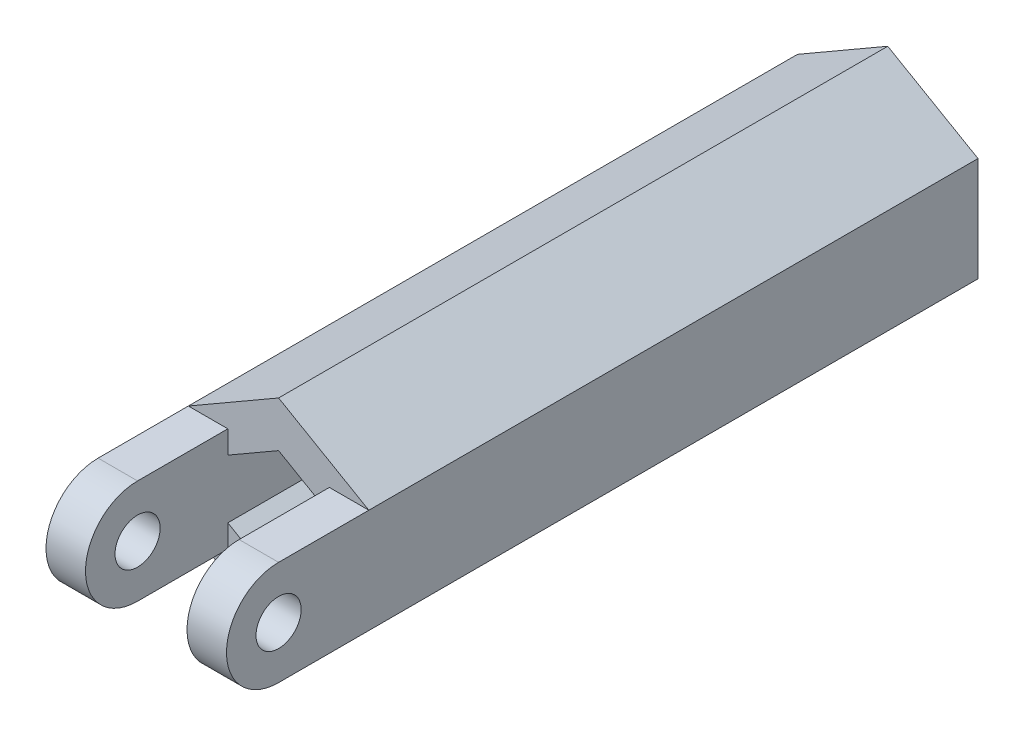
ISO-10303-21;
HEADER;
FILE_DESCRIPTION(('STEP AP214'),'2;1');
FILE_NAME('part.step','',(''),(''),'','','');
FILE_SCHEMA(('AUTOMOTIVE_DESIGN { 1 0 10303 214 1 1 1 1 }'));
ENDSEC;
DATA;
#1=APPLICATION_CONTEXT('core data for automotive mechanical design processes');
#2=APPLICATION_PROTOCOL_DEFINITION('international standard','automotive_design',2000,#1);
#3=PRODUCT_CONTEXT('',#1,'mechanical');
#4=PRODUCT('Part','Part','',(#3));
#5=PRODUCT_RELATED_PRODUCT_CATEGORY('part','',(#4));
#6=PRODUCT_DEFINITION_FORMATION('','',#4);
#7=PRODUCT_DEFINITION_CONTEXT('part definition',#1,'design');
#8=PRODUCT_DEFINITION('design','',#6,#7);
#9=PRODUCT_DEFINITION_SHAPE('','',#8);
#10=(LENGTH_UNIT() NAMED_UNIT(*) SI_UNIT(.MILLI.,.METRE.));
#11=(NAMED_UNIT(*) PLANE_ANGLE_UNIT() SI_UNIT($,.RADIAN.));
#12=(NAMED_UNIT(*) SI_UNIT($,.STERADIAN.) SOLID_ANGLE_UNIT());
#13=UNCERTAINTY_MEASURE_WITH_UNIT(LENGTH_MEASURE(1.E-05),#10,'distance_accuracy_value','');
#14=(GEOMETRIC_REPRESENTATION_CONTEXT(3) GLOBAL_UNCERTAINTY_ASSIGNED_CONTEXT((#13)) GLOBAL_UNIT_ASSIGNED_CONTEXT((#10,
#11,#12)) REPRESENTATION_CONTEXT('',''));
#15=CARTESIAN_POINT('',(0.,0.,0.));
#16=DIRECTION('',(0.,0.,1.));
#17=DIRECTION('',(1.,0.,0.));
#18=AXIS2_PLACEMENT_3D('',#15,#16,#17);
#19=CARTESIAN_POINT('',(0.,0.,25.));
#20=DIRECTION('',(0.,0.,1.));
#21=DIRECTION('',(1.,0.,0.));
#22=AXIS2_PLACEMENT_3D('',#19,#20,#21);
#23=PLANE('',#22);
#24=DIRECTION('',(1.,0.,0.));
#25=VECTOR('',#24,1.);
#26=CARTESIAN_POINT('',(-5.56932703502896,2.30940107675851,25.));
#27=LINE('',#26,#25);
#28=CARTESIAN_POINT('',(2.25,2.30940107675851,25.));
#29=VERTEX_POINT('',#28);
#30=CARTESIAN_POINT('',(4.,2.30940107675851,25.));
#31=VERTEX_POINT('',#30);
#32=EDGE_CURVE('E177',#29,#31,#27,.T.);
#33=ORIENTED_EDGE('',*,*,#32,.T.);
#34=DIRECTION('',(-0.866025403784439,0.5,0.));
#35=VECTOR('',#34,1.);
#36=CARTESIAN_POINT('',(4.,2.30940107675851,25.));
#37=LINE('',#36,#35);
#38=CARTESIAN_POINT('',(0.,4.61880215351701,25.));
#39=VERTEX_POINT('',#38);
#40=EDGE_CURVE('E297',#31,#39,#37,.T.);
#41=ORIENTED_EDGE('',*,*,#40,.T.);
#42=DIRECTION('',(-0.866025403784439,-0.5,0.));
#43=VECTOR('',#42,1.);
#44=CARTESIAN_POINT('',(0.,4.61880215351701,25.));
#45=LINE('',#44,#43);
#46=CARTESIAN_POINT('',(-4.,2.30940107675851,25.));
#47=VERTEX_POINT('',#46);
#48=EDGE_CURVE('E299',#39,#47,#45,.T.);
#49=ORIENTED_EDGE('',*,*,#48,.T.);
#50=DIRECTION('',(-1.,0.,0.));
#51=VECTOR('',#50,1.);
#52=CARTESIAN_POINT('',(5.56932703502895,2.30940107675851,25.));
#53=LINE('',#52,#51);
#54=CARTESIAN_POINT('',(-2.25,2.30940107675851,25.));
#55=VERTEX_POINT('',#54);
#56=EDGE_CURVE('E226',#55,#47,#53,.T.);
#57=ORIENTED_EDGE('',*,*,#56,.F.);
#58=DIRECTION('',(0.,-1.,0.));
#59=VECTOR('',#58,1.);
#60=CARTESIAN_POINT('',(-2.25,2.30940107675851,25.));
#61=LINE('',#60,#59);
#62=CARTESIAN_POINT('',(-2.25,1.29903810567666,25.));
#63=VERTEX_POINT('',#62);
#64=EDGE_CURVE('E43',#55,#63,#61,.T.);
#65=ORIENTED_EDGE('',*,*,#64,.T.);
#66=DIRECTION('',(-0.866025403784439,-0.5,0.));
#67=VECTOR('',#66,1.);
#68=CARTESIAN_POINT('',(0.,2.59807621135332,25.));
#69=LINE('',#68,#67);
#70=CARTESIAN_POINT('',(0.,2.59807621135332,25.));
#71=VERTEX_POINT('',#70);
#72=EDGE_CURVE('E259',#71,#63,#69,.T.);
#73=ORIENTED_EDGE('',*,*,#72,.F.);
#74=DIRECTION('',(-0.866025403784439,0.5,0.));
#75=VECTOR('',#74,1.);
#76=CARTESIAN_POINT('',(2.25,1.29903810567666,25.));
#77=LINE('',#76,#75);
#78=CARTESIAN_POINT('',(2.25,1.29903810567666,25.));
#79=VERTEX_POINT('',#78);
#80=EDGE_CURVE('E189',#79,#71,#77,.T.);
#81=ORIENTED_EDGE('',*,*,#80,.F.);
#82=DIRECTION('',(0.,1.,0.));
#83=VECTOR('',#82,1.);
#84=CARTESIAN_POINT('',(2.25,2.3094010767585,25.));
#85=LINE('',#84,#83);
#86=EDGE_CURVE('E167',#79,#29,#85,.T.);
#87=ORIENTED_EDGE('',*,*,#86,.T.);
#88=EDGE_LOOP('',(#33,#41,#49,#57,#65,#73,#81,#87));
#89=FACE_BOUND('',#88,.T.);
#90=ADVANCED_FACE('F33',(#89),#23,.T.);
#91=DIRECTION('',(1.,0.,0.));
#92=VECTOR('',#91,1.);
#93=CARTESIAN_POINT('',(-5.56932703502896,-2.30940107675851,25.));
#94=LINE('',#93,#92);
#95=CARTESIAN_POINT('',(2.25,-2.30940107675851,25.));
#96=VERTEX_POINT('',#95);
#97=CARTESIAN_POINT('',(4.,-2.3094010767585,25.));
#98=VERTEX_POINT('',#97);
#99=EDGE_CURVE('E199',#96,#98,#94,.T.);
#100=ORIENTED_EDGE('',*,*,#99,.F.);
#101=CARTESIAN_POINT('',(2.25,-1.29903810567666,25.));
#102=VERTEX_POINT('',#101);
#103=EDGE_CURVE('E185',#96,#102,#85,.T.);
#104=ORIENTED_EDGE('',*,*,#103,.T.);
#105=DIRECTION('',(0.866025403784439,0.5,0.));
#106=VECTOR('',#105,1.);
#107=CARTESIAN_POINT('',(0.,-2.59807621135332,25.));
#108=LINE('',#107,#106);
#109=CARTESIAN_POINT('',(0.,-2.59807621135332,25.));
#110=VERTEX_POINT('',#109);
#111=EDGE_CURVE('E265',#110,#102,#108,.T.);
#112=ORIENTED_EDGE('',*,*,#111,.F.);
#113=DIRECTION('',(0.866025403784439,-0.5,0.));
#114=VECTOR('',#113,1.);
#115=CARTESIAN_POINT('',(-2.25,-1.29903810567666,25.));
#116=LINE('',#115,#114);
#117=CARTESIAN_POINT('',(-2.25,-1.29903810567666,25.));
#118=VERTEX_POINT('',#117);
#119=EDGE_CURVE('E263',#118,#110,#116,.T.);
#120=ORIENTED_EDGE('',*,*,#119,.F.);
#121=CARTESIAN_POINT('',(-2.25,-2.3094010767585,25.));
#122=VERTEX_POINT('',#121);
#123=EDGE_CURVE('E11',#118,#122,#61,.T.);
#124=ORIENTED_EDGE('',*,*,#123,.T.);
#125=DIRECTION('',(-1.,0.,0.));
#126=VECTOR('',#125,1.);
#127=CARTESIAN_POINT('',(5.56932703502895,-2.3094010767585,25.));
#128=LINE('',#127,#126);
#129=CARTESIAN_POINT('',(-4.,-2.3094010767585,25.));
#130=VERTEX_POINT('',#129);
#131=EDGE_CURVE('E222',#122,#130,#128,.T.);
#132=ORIENTED_EDGE('',*,*,#131,.T.);
#133=DIRECTION('',(0.866025403784439,-0.5,0.));
#134=VECTOR('',#133,1.);
#135=CARTESIAN_POINT('',(-4.,-2.3094010767585,25.));
#136=LINE('',#135,#134);
#137=CARTESIAN_POINT('',(0.,-4.61880215351701,25.));
#138=VERTEX_POINT('',#137);
#139=EDGE_CURVE('E50',#130,#138,#136,.T.);
#140=ORIENTED_EDGE('',*,*,#139,.T.);
#141=DIRECTION('',(0.866025403784439,0.5,0.));
#142=VECTOR('',#141,1.);
#143=CARTESIAN_POINT('',(0.,-4.61880215351701,25.));
#144=LINE('',#143,#142);
#145=EDGE_CURVE('E303',#138,#98,#144,.T.);
#146=ORIENTED_EDGE('',*,*,#145,.T.);
#147=EDGE_LOOP('',(#100,#104,#112,#120,#124,#132,#140,#146));
#148=FACE_BOUND('',#147,.T.);
#149=ADVANCED_FACE('F339',(#148),#23,.T.);
#150=CARTESIAN_POINT('',(4.,2.30940107675851,25.));
#151=DIRECTION('',(-0.5,-0.866025403784439,0.));
#152=DIRECTION('',(0.866025403784439,-0.5,0.));
#153=AXIS2_PLACEMENT_3D('',#150,#151,#152);
#154=PLANE('',#153);
#155=DIRECTION('',(0.,0.,-1.));
#156=VECTOR('',#155,1.);
#157=CARTESIAN_POINT('',(4.,2.30940107675851,25.));
#158=LINE('',#157,#156);
#159=CARTESIAN_POINT('',(4.,2.30940107675851,-2.));
#160=VERTEX_POINT('',#159);
#161=EDGE_CURVE('E305',#31,#160,#158,.T.);
#162=ORIENTED_EDGE('',*,*,#161,.T.);
#163=DIRECTION('',(0.866025403784439,-0.5,0.));
#164=VECTOR('',#163,1.);
#165=CARTESIAN_POINT('',(0.,4.61880215351701,-2.));
#166=LINE('',#165,#164);
#167=CARTESIAN_POINT('',(0.,4.61880215351701,-2.));
#168=VERTEX_POINT('',#167);
#169=EDGE_CURVE('E242',#168,#160,#166,.T.);
#170=ORIENTED_EDGE('',*,*,#169,.F.);
#171=DIRECTION('',(0.,0.,-1.));
#172=VECTOR('',#171,1.);
#173=CARTESIAN_POINT('',(0.,4.61880215351701,25.));
#174=LINE('',#173,#172);
#175=EDGE_CURVE('E37',#39,#168,#174,.T.);
#176=ORIENTED_EDGE('',*,*,#175,.F.);
#177=ORIENTED_EDGE('',*,*,#40,.F.);
#178=EDGE_LOOP('',(#162,#170,#176,#177));
#179=FACE_BOUND('',#178,.T.);
#180=ADVANCED_FACE('F35',(#179),#154,.F.);
#181=CARTESIAN_POINT('',(0.,4.61880215351701,25.));
#182=DIRECTION('',(0.5,-0.866025403784439,0.));
#183=DIRECTION('',(0.866025403784439,0.5,0.));
#184=AXIS2_PLACEMENT_3D('',#181,#182,#183);
#185=PLANE('',#184);
#186=ORIENTED_EDGE('',*,*,#175,.T.);
#187=DIRECTION('',(0.866025403784439,0.5,0.));
#188=VECTOR('',#187,1.);
#189=CARTESIAN_POINT('',(-4.,2.3094010767585,-2.));
#190=LINE('',#189,#188);
#191=CARTESIAN_POINT('',(-4.,2.3094010767585,-2.));
#192=VERTEX_POINT('',#191);
#193=EDGE_CURVE('E237',#192,#168,#190,.T.);
#194=ORIENTED_EDGE('',*,*,#193,.F.);
#195=DIRECTION('',(0.,0.,-1.));
#196=VECTOR('',#195,1.);
#197=CARTESIAN_POINT('',(-4.,2.30940107675851,25.));
#198=LINE('',#197,#196);
#199=EDGE_CURVE('E312',#47,#192,#198,.T.);
#200=ORIENTED_EDGE('',*,*,#199,.F.);
#201=ORIENTED_EDGE('',*,*,#48,.F.);
#202=EDGE_LOOP('',(#186,#194,#200,#201));
#203=FACE_BOUND('',#202,.T.);
#204=ADVANCED_FACE('F320',(#203),#185,.F.);
#205=CARTESIAN_POINT('',(-4.,2.30940107675851,25.));
#206=DIRECTION('',(1.,0.,0.));
#207=DIRECTION('',(0.,0.,-1.));
#208=AXIS2_PLACEMENT_3D('',#205,#206,#207);
#209=PLANE('',#208);
#210=ORIENTED_EDGE('',*,*,#199,.T.);
#211=DIRECTION('',(0.,1.,0.));
#212=VECTOR('',#211,1.);
#213=CARTESIAN_POINT('',(-4.,-2.3094010767585,-2.));
#214=LINE('',#213,#212);
#215=CARTESIAN_POINT('',(-4.,-2.3094010767585,-2.));
#216=VERTEX_POINT('',#215);
#217=EDGE_CURVE('E254',#216,#192,#214,.T.);
#218=ORIENTED_EDGE('',*,*,#217,.F.);
#219=DIRECTION('',(0.,0.,-1.));
#220=VECTOR('',#219,1.);
#221=CARTESIAN_POINT('',(-4.,-2.3094010767585,25.));
#222=LINE('',#221,#220);
#223=EDGE_CURVE('E311',#130,#216,#222,.T.);
#224=ORIENTED_EDGE('',*,*,#223,.F.);
#225=DIRECTION('',(0.,0.,1.));
#226=VECTOR('',#225,1.);
#227=CARTESIAN_POINT('',(-4.,-2.3094010767585,25.));
#228=LINE('',#227,#226);
#229=CARTESIAN_POINT('',(-4.,-2.3094010767585,29.));
#230=VERTEX_POINT('',#229);
#231=EDGE_CURVE('E58',#130,#230,#228,.T.);
#232=ORIENTED_EDGE('',*,*,#231,.T.);
#233=CARTESIAN_POINT('',(-4.,0.,29.));
#234=DIRECTION('',(-1.,0.,0.));
#235=DIRECTION('',(0.,0.,1.));
#236=AXIS2_PLACEMENT_3D('',#233,#234,#235);
#237=CIRCLE('',#236,2.3094010767585);
#238=CARTESIAN_POINT('',(-4.,2.30940107675851,29.));
#239=VERTEX_POINT('',#238);
#240=EDGE_CURVE('E207',#230,#239,#237,.T.);
#241=ORIENTED_EDGE('',*,*,#240,.T.);
#242=DIRECTION('',(0.,0.,-1.));
#243=VECTOR('',#242,1.);
#244=CARTESIAN_POINT('',(-4.,2.30940107675851,25.));
#245=LINE('',#244,#243);
#246=EDGE_CURVE('E203',#239,#47,#245,.T.);
#247=ORIENTED_EDGE('',*,*,#246,.T.);
#248=EDGE_LOOP('',(#210,#218,#224,#232,#241,#247));
#249=FACE_BOUND('',#248,.T.);
#250=CARTESIAN_POINT('',(-4.,0.,29.));
#251=DIRECTION('',(-1.,0.,0.));
#252=DIRECTION('',(0.,0.,1.));
#253=AXIS2_PLACEMENT_3D('',#250,#251,#252);
#254=CIRCLE('',#253,1.);
#255=CARTESIAN_POINT('',(-4.,0.,30.));
#256=VERTEX_POINT('',#255);
#257=EDGE_CURVE('E211',#256,#256,#254,.T.);
#258=ORIENTED_EDGE('',*,*,#257,.F.);
#259=EDGE_LOOP('',(#258));
#260=FACE_BOUND('',#259,.T.);
#261=ADVANCED_FACE('F329',(#249,#260),#209,.F.);
#262=CARTESIAN_POINT('',(-4.,-2.3094010767585,25.));
#263=DIRECTION('',(0.5,0.866025403784438,0.));
#264=DIRECTION('',(-0.866025403784439,0.5,0.));
#265=AXIS2_PLACEMENT_3D('',#262,#263,#264);
#266=PLANE('',#265);
#267=ORIENTED_EDGE('',*,*,#223,.T.);
#268=DIRECTION('',(-0.866025403784439,0.5,0.));
#269=VECTOR('',#268,1.);
#270=CARTESIAN_POINT('',(0.,-4.61880215351701,-2.));
#271=LINE('',#270,#269);
#272=CARTESIAN_POINT('',(0.,-4.61880215351701,-2.));
#273=VERTEX_POINT('',#272);
#274=EDGE_CURVE('E251',#273,#216,#271,.T.);
#275=ORIENTED_EDGE('',*,*,#274,.F.);
#276=DIRECTION('',(0.,0.,-1.));
#277=VECTOR('',#276,1.);
#278=CARTESIAN_POINT('',(0.,-4.61880215351701,25.));
#279=LINE('',#278,#277);
#280=EDGE_CURVE('E309',#138,#273,#279,.T.);
#281=ORIENTED_EDGE('',*,*,#280,.F.);
#282=ORIENTED_EDGE('',*,*,#139,.F.);
#283=EDGE_LOOP('',(#267,#275,#281,#282));
#284=FACE_BOUND('',#283,.T.);
#285=ADVANCED_FACE('F332',(#284),#266,.F.);
#286=CARTESIAN_POINT('',(0.,-4.61880215351701,25.));
#287=DIRECTION('',(-0.5,0.866025403784439,0.));
#288=DIRECTION('',(-0.866025403784439,-0.5,0.));
#289=AXIS2_PLACEMENT_3D('',#286,#287,#288);
#290=PLANE('',#289);
#291=ORIENTED_EDGE('',*,*,#280,.T.);
#292=DIRECTION('',(-0.866025403784439,-0.5,0.));
#293=VECTOR('',#292,1.);
#294=CARTESIAN_POINT('',(4.,-2.3094010767585,-2.));
#295=LINE('',#294,#293);
#296=CARTESIAN_POINT('',(4.,-2.3094010767585,-2.));
#297=VERTEX_POINT('',#296);
#298=EDGE_CURVE('E248',#297,#273,#295,.T.);
#299=ORIENTED_EDGE('',*,*,#298,.F.);
#300=DIRECTION('',(0.,0.,-1.));
#301=VECTOR('',#300,1.);
#302=CARTESIAN_POINT('',(4.,-2.3094010767585,25.));
#303=LINE('',#302,#301);
#304=EDGE_CURVE('E307',#98,#297,#303,.T.);
#305=ORIENTED_EDGE('',*,*,#304,.F.);
#306=ORIENTED_EDGE('',*,*,#145,.F.);
#307=EDGE_LOOP('',(#291,#299,#305,#306));
#308=FACE_BOUND('',#307,.T.);
#309=ADVANCED_FACE('F337',(#308),#290,.F.);
#310=CARTESIAN_POINT('',(4.,-2.3094010767585,25.));
#311=DIRECTION('',(-1.,0.,0.));
#312=DIRECTION('',(0.,-1.,0.));
#313=AXIS2_PLACEMENT_3D('',#310,#311,#312);
#314=PLANE('',#313);
#315=ORIENTED_EDGE('',*,*,#304,.T.);
#316=DIRECTION('',(0.,-1.,0.));
#317=VECTOR('',#316,1.);
#318=CARTESIAN_POINT('',(4.,2.30940107675851,-2.));
#319=LINE('',#318,#317);
#320=EDGE_CURVE('E245',#160,#297,#319,.T.);
#321=ORIENTED_EDGE('',*,*,#320,.F.);
#322=ORIENTED_EDGE('',*,*,#161,.F.);
#323=DIRECTION('',(0.,0.,1.));
#324=VECTOR('',#323,1.);
#325=CARTESIAN_POINT('',(4.,2.30940107675851,29.));
#326=LINE('',#325,#324);
#327=CARTESIAN_POINT('',(4.,2.30940107675851,29.));
#328=VERTEX_POINT('',#327);
#329=EDGE_CURVE('E180',#31,#328,#326,.T.);
#330=ORIENTED_EDGE('',*,*,#329,.T.);
#331=CARTESIAN_POINT('',(4.,0.,29.));
#332=DIRECTION('',(1.,0.,0.));
#333=DIRECTION('',(0.,1.,0.));
#334=AXIS2_PLACEMENT_3D('',#331,#332,#333);
#335=CIRCLE('',#334,2.3094010767585);
#336=CARTESIAN_POINT('',(4.,-2.3094010767585,29.));
#337=VERTEX_POINT('',#336);
#338=EDGE_CURVE('E353',#328,#337,#335,.T.);
#339=ORIENTED_EDGE('',*,*,#338,.T.);
#340=DIRECTION('',(0.,0.,-1.));
#341=VECTOR('',#340,1.);
#342=CARTESIAN_POINT('',(4.,-2.3094010767585,25.));
#343=LINE('',#342,#341);
#344=EDGE_CURVE('E347',#337,#98,#343,.T.);
#345=ORIENTED_EDGE('',*,*,#344,.T.);
#346=EDGE_LOOP('',(#315,#321,#322,#330,#339,#345));
#347=FACE_BOUND('',#346,.T.);
#348=CARTESIAN_POINT('',(4.,0.,29.));
#349=DIRECTION('',(1.,0.,0.));
#350=DIRECTION('',(0.,1.,0.));
#351=AXIS2_PLACEMENT_3D('',#348,#349,#350);
#352=CIRCLE('',#351,1.);
#353=CARTESIAN_POINT('',(4.,1.,29.));
#354=VERTEX_POINT('',#353);
#355=EDGE_CURVE('E184',#354,#354,#352,.T.);
#356=ORIENTED_EDGE('',*,*,#355,.F.);
#357=EDGE_LOOP('',(#356));
#358=FACE_BOUND('',#357,.T.);
#359=ADVANCED_FACE('F350',(#347,#358),#314,.F.);
#360=CARTESIAN_POINT('',(2.25,1.29903810567666,25.));
#361=DIRECTION('',(-0.5,-0.866025403784439,0.));
#362=DIRECTION('',(0.866025403784439,-0.5,0.));
#363=AXIS2_PLACEMENT_3D('',#360,#361,#362);
#364=PLANE('',#363);
#365=DIRECTION('',(-0.866025403784439,0.5,0.));
#366=VECTOR('',#365,1.);
#367=CARTESIAN_POINT('',(2.25,1.29903810567666,0.));
#368=LINE('',#367,#366);
#369=CARTESIAN_POINT('',(2.25,1.29903810567666,0.));
#370=VERTEX_POINT('',#369);
#371=CARTESIAN_POINT('',(0.,2.59807621135332,0.));
#372=VERTEX_POINT('',#371);
#373=EDGE_CURVE('E257',#370,#372,#368,.T.);
#374=ORIENTED_EDGE('',*,*,#373,.F.);
#375=DIRECTION('',(0.,0.,-1.));
#376=VECTOR('',#375,1.);
#377=CARTESIAN_POINT('',(2.25,1.29903810567666,25.));
#378=LINE('',#377,#376);
#379=EDGE_CURVE('E268',#79,#370,#378,.T.);
#380=ORIENTED_EDGE('',*,*,#379,.F.);
#381=ORIENTED_EDGE('',*,*,#80,.T.);
#382=DIRECTION('',(0.,0.,-1.));
#383=VECTOR('',#382,1.);
#384=CARTESIAN_POINT('',(0.,2.59807621135332,25.));
#385=LINE('',#384,#383);
#386=EDGE_CURVE('E294',#71,#372,#385,.T.);
#387=ORIENTED_EDGE('',*,*,#386,.T.);
#388=EDGE_LOOP('',(#374,#380,#381,#387));
#389=FACE_BOUND('',#388,.T.);
#390=ADVANCED_FACE('F379',(#389),#364,.T.);
#391=CARTESIAN_POINT('',(0.,2.59807621135332,25.));
#392=DIRECTION('',(0.5,-0.866025403784439,0.));
#393=DIRECTION('',(0.866025403784439,0.5,0.));
#394=AXIS2_PLACEMENT_3D('',#391,#392,#393);
#395=PLANE('',#394);
#396=DIRECTION('',(-0.866025403784439,-0.5,0.));
#397=VECTOR('',#396,1.);
#398=CARTESIAN_POINT('',(0.,2.59807621135332,0.));
#399=LINE('',#398,#397);
#400=CARTESIAN_POINT('',(-2.25,1.29903810567666,0.));
#401=VERTEX_POINT('',#400);
#402=EDGE_CURVE('E271',#372,#401,#399,.T.);
#403=ORIENTED_EDGE('',*,*,#402,.F.);
#404=ORIENTED_EDGE('',*,*,#386,.F.);
#405=ORIENTED_EDGE('',*,*,#72,.T.);
#406=DIRECTION('',(0.,0.,-1.));
#407=VECTOR('',#406,1.);
#408=CARTESIAN_POINT('',(-2.25,1.29903810567666,25.));
#409=LINE('',#408,#407);
#410=EDGE_CURVE('E292',#63,#401,#409,.T.);
#411=ORIENTED_EDGE('',*,*,#410,.T.);
#412=EDGE_LOOP('',(#403,#404,#405,#411));
#413=FACE_BOUND('',#412,.T.);
#414=ADVANCED_FACE('F470',(#413),#395,.T.);
#415=CARTESIAN_POINT('',(-2.25,1.29903810567666,25.));
#416=DIRECTION('',(1.,0.,0.));
#417=DIRECTION('',(0.,0.,-1.));
#418=AXIS2_PLACEMENT_3D('',#415,#416,#417);
#419=PLANE('',#418);
#420=DIRECTION('',(0.,-1.,0.));
#421=VECTOR('',#420,1.);
#422=CARTESIAN_POINT('',(-2.25,1.29903810567666,0.));
#423=LINE('',#422,#421);
#424=CARTESIAN_POINT('',(-2.25,-1.29903810567666,0.));
#425=VERTEX_POINT('',#424);
#426=EDGE_CURVE('E274',#401,#425,#423,.T.);
#427=ORIENTED_EDGE('',*,*,#426,.F.);
#428=ORIENTED_EDGE('',*,*,#410,.F.);
#429=ORIENTED_EDGE('',*,*,#64,.F.);
#430=DIRECTION('',(0.,0.,-1.));
#431=VECTOR('',#430,1.);
#432=CARTESIAN_POINT('',(-2.25,2.30940107675851,25.));
#433=LINE('',#432,#431);
#434=CARTESIAN_POINT('',(-2.25,2.30940107675851,29.));
#435=VERTEX_POINT('',#434);
#436=EDGE_CURVE('E223',#435,#55,#433,.T.);
#437=ORIENTED_EDGE('',*,*,#436,.F.);
#438=CARTESIAN_POINT('',(-2.25,0.,29.));
#439=DIRECTION('',(1.,0.,0.));
#440=DIRECTION('',(0.,0.,-1.));
#441=AXIS2_PLACEMENT_3D('',#438,#439,#440);
#442=CIRCLE('',#441,2.3094010767585);
#443=CARTESIAN_POINT('',(-2.25,-2.3094010767585,29.));
#444=VERTEX_POINT('',#443);
#445=EDGE_CURVE('E227',#444,#435,#442,.F.);
#446=ORIENTED_EDGE('',*,*,#445,.F.);
#447=DIRECTION('',(0.,0.,1.));
#448=VECTOR('',#447,1.);
#449=CARTESIAN_POINT('',(-2.25,-2.3094010767585,25.));
#450=LINE('',#449,#448);
#451=EDGE_CURVE('E218',#122,#444,#450,.T.);
#452=ORIENTED_EDGE('',*,*,#451,.F.);
#453=ORIENTED_EDGE('',*,*,#123,.F.);
#454=DIRECTION('',(0.,0.,-1.));
#455=VECTOR('',#454,1.);
#456=CARTESIAN_POINT('',(-2.25,-1.29903810567666,25.));
#457=LINE('',#456,#455);
#458=EDGE_CURVE('E290',#118,#425,#457,.T.);
#459=ORIENTED_EDGE('',*,*,#458,.T.);
#460=EDGE_LOOP('',(#427,#428,#429,#437,#446,#452,#453,#459));
#461=FACE_BOUND('',#460,.T.);
#462=CARTESIAN_POINT('',(-2.25,0.,29.));
#463=DIRECTION('',(1.,0.,0.));
#464=DIRECTION('',(0.,0.,-1.));
#465=AXIS2_PLACEMENT_3D('',#462,#463,#464);
#466=CIRCLE('',#465,1.);
#467=CARTESIAN_POINT('',(-2.25,0.,28.));
#468=VERTEX_POINT('',#467);
#469=EDGE_CURVE('E206',#468,#468,#466,.F.);
#470=ORIENTED_EDGE('',*,*,#469,.T.);
#471=EDGE_LOOP('',(#470));
#472=FACE_BOUND('',#471,.T.);
#473=ADVANCED_FACE('F458',(#461,#472),#419,.T.);
#474=CARTESIAN_POINT('',(-2.25,-1.29903810567666,25.));
#475=DIRECTION('',(0.5,0.866025403784439,0.));
#476=DIRECTION('',(-0.866025403784439,0.5,0.));
#477=AXIS2_PLACEMENT_3D('',#474,#475,#476);
#478=PLANE('',#477);
#479=DIRECTION('',(0.866025403784439,-0.5,0.));
#480=VECTOR('',#479,1.);
#481=CARTESIAN_POINT('',(-2.25,-1.29903810567666,0.));
#482=LINE('',#481,#480);
#483=CARTESIAN_POINT('',(0.,-2.59807621135332,0.));
#484=VERTEX_POINT('',#483);
#485=EDGE_CURVE('E277',#425,#484,#482,.T.);
#486=ORIENTED_EDGE('',*,*,#485,.F.);
#487=ORIENTED_EDGE('',*,*,#458,.F.);
#488=ORIENTED_EDGE('',*,*,#119,.T.);
#489=DIRECTION('',(0.,0.,-1.));
#490=VECTOR('',#489,1.);
#491=CARTESIAN_POINT('',(0.,-2.59807621135332,25.));
#492=LINE('',#491,#490);
#493=EDGE_CURVE('E288',#110,#484,#492,.T.);
#494=ORIENTED_EDGE('',*,*,#493,.T.);
#495=EDGE_LOOP('',(#486,#487,#488,#494));
#496=FACE_BOUND('',#495,.T.);
#497=ADVANCED_FACE('F452',(#496),#478,.T.);
#498=CARTESIAN_POINT('',(0.,-2.59807621135332,25.));
#499=DIRECTION('',(-0.5,0.866025403784439,0.));
#500=DIRECTION('',(-0.866025403784439,-0.5,0.));
#501=AXIS2_PLACEMENT_3D('',#498,#499,#500);
#502=PLANE('',#501);
#503=DIRECTION('',(0.866025403784439,0.5,0.));
#504=VECTOR('',#503,1.);
#505=CARTESIAN_POINT('',(0.,-2.59807621135332,0.));
#506=LINE('',#505,#504);
#507=CARTESIAN_POINT('',(2.25,-1.29903810567666,0.));
#508=VERTEX_POINT('',#507);
#509=EDGE_CURVE('E280',#484,#508,#506,.T.);
#510=ORIENTED_EDGE('',*,*,#509,.F.);
#511=ORIENTED_EDGE('',*,*,#493,.F.);
#512=ORIENTED_EDGE('',*,*,#111,.T.);
#513=DIRECTION('',(0.,0.,-1.));
#514=VECTOR('',#513,1.);
#515=CARTESIAN_POINT('',(2.25,-1.29903810567666,25.));
#516=LINE('',#515,#514);
#517=EDGE_CURVE('E286',#102,#508,#516,.T.);
#518=ORIENTED_EDGE('',*,*,#517,.T.);
#519=EDGE_LOOP('',(#510,#511,#512,#518));
#520=FACE_BOUND('',#519,.T.);
#521=ADVANCED_FACE('F457',(#520),#502,.T.);
#522=CARTESIAN_POINT('',(2.25,-1.29903810567666,25.));
#523=DIRECTION('',(-1.,0.,0.));
#524=DIRECTION('',(0.,-1.,0.));
#525=AXIS2_PLACEMENT_3D('',#522,#523,#524);
#526=PLANE('',#525);
#527=DIRECTION('',(0.,1.,0.));
#528=VECTOR('',#527,1.);
#529=CARTESIAN_POINT('',(2.25,-1.29903810567666,0.));
#530=LINE('',#529,#528);
#531=EDGE_CURVE('E260',#508,#370,#530,.T.);
#532=ORIENTED_EDGE('',*,*,#531,.F.);
#533=ORIENTED_EDGE('',*,*,#517,.F.);
#534=ORIENTED_EDGE('',*,*,#103,.F.);
#535=DIRECTION('',(0.,0.,-1.));
#536=VECTOR('',#535,1.);
#537=CARTESIAN_POINT('',(2.25,-2.30940107675851,25.));
#538=LINE('',#537,#536);
#539=CARTESIAN_POINT('',(2.25,-2.3094010767585,29.));
#540=VERTEX_POINT('',#539);
#541=EDGE_CURVE('E196',#540,#96,#538,.T.);
#542=ORIENTED_EDGE('',*,*,#541,.F.);
#543=CARTESIAN_POINT('',(2.25,0.,29.));
#544=DIRECTION('',(-1.,0.,0.));
#545=DIRECTION('',(0.,-1.,0.));
#546=AXIS2_PLACEMENT_3D('',#543,#544,#545);
#547=CIRCLE('',#546,2.3094010767585);
#548=CARTESIAN_POINT('',(2.25,2.30940107675851,29.));
#549=VERTEX_POINT('',#548);
#550=EDGE_CURVE('E170',#549,#540,#547,.F.);
#551=ORIENTED_EDGE('',*,*,#550,.F.);
#552=DIRECTION('',(0.,0.,1.));
#553=VECTOR('',#552,1.);
#554=CARTESIAN_POINT('',(2.25,2.30940107675851,29.));
#555=LINE('',#554,#553);
#556=EDGE_CURVE('E161',#29,#549,#555,.T.);
#557=ORIENTED_EDGE('',*,*,#556,.F.);
#558=ORIENTED_EDGE('',*,*,#86,.F.);
#559=ORIENTED_EDGE('',*,*,#379,.T.);
#560=EDGE_LOOP('',(#532,#533,#534,#542,#551,#557,#558,#559));
#561=FACE_BOUND('',#560,.T.);
#562=CARTESIAN_POINT('',(2.25,0.,29.));
#563=DIRECTION('',(-1.,0.,0.));
#564=DIRECTION('',(0.,-1.,0.));
#565=AXIS2_PLACEMENT_3D('',#562,#563,#564);
#566=CIRCLE('',#565,1.);
#567=CARTESIAN_POINT('',(2.25,-0.999999999999999,29.));
#568=VERTEX_POINT('',#567);
#569=EDGE_CURVE('E194',#568,#568,#566,.F.);
#570=ORIENTED_EDGE('',*,*,#569,.T.);
#571=EDGE_LOOP('',(#570));
#572=FACE_BOUND('',#571,.T.);
#573=ADVANCED_FACE('F164',(#561,#572),#526,.T.);
#574=CARTESIAN_POINT('',(0.,0.,-2.));
#575=DIRECTION('',(0.,0.,-1.));
#576=DIRECTION('',(-1.,0.,0.));
#577=AXIS2_PLACEMENT_3D('',#574,#575,#576);
#578=PLANE('',#577);
#579=ORIENTED_EDGE('',*,*,#193,.T.);
#580=ORIENTED_EDGE('',*,*,#169,.T.);
#581=ORIENTED_EDGE('',*,*,#320,.T.);
#582=ORIENTED_EDGE('',*,*,#298,.T.);
#583=ORIENTED_EDGE('',*,*,#274,.T.);
#584=ORIENTED_EDGE('',*,*,#217,.T.);
#585=EDGE_LOOP('',(#579,#580,#581,#582,#583,#584));
#586=FACE_BOUND('',#585,.T.);
#587=CARTESIAN_POINT('',(0.,0.,-2.));
#588=DIRECTION('',(0.,0.,-1.));
#589=DIRECTION('',(-1.,0.,0.));
#590=AXIS2_PLACEMENT_3D('',#587,#588,#589);
#591=CIRCLE('',#590,1.25);
#592=CARTESIAN_POINT('',(-1.25,0.,-2.));
#593=VERTEX_POINT('',#592);
#594=EDGE_CURVE('E234',#593,#593,#591,.T.);
#595=ORIENTED_EDGE('',*,*,#594,.F.);
#596=EDGE_LOOP('',(#595));
#597=FACE_BOUND('',#596,.T.);
#598=ADVANCED_FACE('F325',(#586,#597),#578,.T.);
#599=CARTESIAN_POINT('',(0.,0.,0.));
#600=DIRECTION('',(0.,0.,-1.));
#601=DIRECTION('',(-1.,0.,0.));
#602=AXIS2_PLACEMENT_3D('',#599,#600,#601);
#603=PLANE('',#602);
#604=ORIENTED_EDGE('',*,*,#373,.T.);
#605=ORIENTED_EDGE('',*,*,#402,.T.);
#606=ORIENTED_EDGE('',*,*,#426,.T.);
#607=ORIENTED_EDGE('',*,*,#485,.T.);
#608=ORIENTED_EDGE('',*,*,#509,.T.);
#609=ORIENTED_EDGE('',*,*,#531,.T.);
#610=EDGE_LOOP('',(#604,#605,#606,#607,#608,#609));
#611=FACE_BOUND('',#610,.T.);
#612=CARTESIAN_POINT('',(0.,0.,0.));
#613=DIRECTION('',(0.,0.,-1.));
#614=DIRECTION('',(-1.,0.,0.));
#615=AXIS2_PLACEMENT_3D('',#612,#613,#614);
#616=CIRCLE('',#615,1.25);
#617=CARTESIAN_POINT('',(-1.25,0.,0.));
#618=VERTEX_POINT('',#617);
#619=EDGE_CURVE('E217',#618,#618,#616,.T.);
#620=ORIENTED_EDGE('',*,*,#619,.T.);
#621=EDGE_LOOP('',(#620));
#622=FACE_BOUND('',#621,.T.);
#623=ADVANCED_FACE('F509',(#611,#622),#603,.F.);
#624=CARTESIAN_POINT('',(0.,0.,-2.));
#625=DIRECTION('',(0.,0.,1.));
#626=DIRECTION('',(1.,0.,0.));
#627=AXIS2_PLACEMENT_3D('',#624,#625,#626);
#628=CYLINDRICAL_SURFACE('',#627,1.25);
#629=ORIENTED_EDGE('',*,*,#594,.T.);
#630=EDGE_LOOP('',(#629));
#631=FACE_BOUND('',#630,.T.);
#632=ORIENTED_EDGE('',*,*,#619,.F.);
#633=EDGE_LOOP('',(#632));
#634=FACE_BOUND('',#633,.T.);
#635=ADVANCED_FACE('F444',(#631,#634),#628,.F.);
#636=CARTESIAN_POINT('',(5.56932703502895,2.30940107675851,25.));
#637=DIRECTION('',(0.,1.,0.));
#638=DIRECTION('',(0.,0.,1.));
#639=AXIS2_PLACEMENT_3D('',#636,#637,#638);
#640=PLANE('',#639);
#641=DIRECTION('',(-1.,0.,0.));
#642=VECTOR('',#641,1.);
#643=CARTESIAN_POINT('',(5.56932703502895,2.30940107675851,29.));
#644=LINE('',#643,#642);
#645=EDGE_CURVE('E220',#435,#239,#644,.T.);
#646=ORIENTED_EDGE('',*,*,#645,.F.);
#647=ORIENTED_EDGE('',*,*,#436,.T.);
#648=ORIENTED_EDGE('',*,*,#56,.T.);
#649=ORIENTED_EDGE('',*,*,#246,.F.);
#650=EDGE_LOOP('',(#646,#647,#648,#649));
#651=FACE_BOUND('',#650,.T.);
#652=ADVANCED_FACE('F434',(#651),#640,.T.);
#653=CARTESIAN_POINT('',(5.56932703502895,0.,29.));
#654=DIRECTION('',(-1.,0.,0.));
#655=DIRECTION('',(0.,0.,1.));
#656=AXIS2_PLACEMENT_3D('',#653,#654,#655);
#657=CYLINDRICAL_SURFACE('',#656,2.3094010767585);
#658=DIRECTION('',(-1.,0.,0.));
#659=VECTOR('',#658,1.);
#660=CARTESIAN_POINT('',(5.56932703502895,-2.3094010767585,29.));
#661=LINE('',#660,#659);
#662=EDGE_CURVE('E214',#444,#230,#661,.T.);
#663=ORIENTED_EDGE('',*,*,#662,.F.);
#664=ORIENTED_EDGE('',*,*,#445,.T.);
#665=ORIENTED_EDGE('',*,*,#645,.T.);
#666=ORIENTED_EDGE('',*,*,#240,.F.);
#667=EDGE_LOOP('',(#663,#664,#665,#666));
#668=FACE_BOUND('',#667,.T.);
#669=ADVANCED_FACE('F426',(#668),#657,.T.);
#670=CARTESIAN_POINT('',(5.56932703502895,-2.3094010767585,25.));
#671=DIRECTION('',(0.,-1.,0.));
#672=DIRECTION('',(0.,0.,-1.));
#673=AXIS2_PLACEMENT_3D('',#670,#671,#672);
#674=PLANE('',#673);
#675=ORIENTED_EDGE('',*,*,#131,.F.);
#676=ORIENTED_EDGE('',*,*,#451,.T.);
#677=ORIENTED_EDGE('',*,*,#662,.T.);
#678=ORIENTED_EDGE('',*,*,#231,.F.);
#679=EDGE_LOOP('',(#675,#676,#677,#678));
#680=FACE_BOUND('',#679,.T.);
#681=ADVANCED_FACE('F415',(#680),#674,.T.);
#682=CARTESIAN_POINT('',(5.56932703502895,0.,29.));
#683=DIRECTION('',(-1.,0.,0.));
#684=DIRECTION('',(0.,0.,1.));
#685=AXIS2_PLACEMENT_3D('',#682,#683,#684);
#686=CYLINDRICAL_SURFACE('',#685,1.);
#687=ORIENTED_EDGE('',*,*,#257,.T.);
#688=EDGE_LOOP('',(#687));
#689=FACE_BOUND('',#688,.T.);
#690=ORIENTED_EDGE('',*,*,#469,.F.);
#691=EDGE_LOOP('',(#690));
#692=FACE_BOUND('',#691,.T.);
#693=ADVANCED_FACE('F411',(#689,#692),#686,.F.);
#694=CARTESIAN_POINT('',(-5.56932703502896,-2.30940107675851,25.));
#695=DIRECTION('',(0.,-1.,0.));
#696=DIRECTION('',(0.,0.,-1.));
#697=AXIS2_PLACEMENT_3D('',#694,#695,#696);
#698=PLANE('',#697);
#699=DIRECTION('',(1.,0.,0.));
#700=VECTOR('',#699,1.);
#701=CARTESIAN_POINT('',(-5.56932703502896,-2.3094010767585,29.));
#702=LINE('',#701,#700);
#703=EDGE_CURVE('E174',#540,#337,#702,.T.);
#704=ORIENTED_EDGE('',*,*,#703,.F.);
#705=ORIENTED_EDGE('',*,*,#541,.T.);
#706=ORIENTED_EDGE('',*,*,#99,.T.);
#707=ORIENTED_EDGE('',*,*,#344,.F.);
#708=EDGE_LOOP('',(#704,#705,#706,#707));
#709=FACE_BOUND('',#708,.T.);
#710=ADVANCED_FACE('F346',(#709),#698,.T.);
#711=CARTESIAN_POINT('',(-5.56932703502896,0.,29.));
#712=DIRECTION('',(1.,0.,0.));
#713=DIRECTION('',(0.,1.,0.));
#714=AXIS2_PLACEMENT_3D('',#711,#712,#713);
#715=CYLINDRICAL_SURFACE('',#714,2.3094010767585);
#716=DIRECTION('',(1.,0.,0.));
#717=VECTOR('',#716,1.);
#718=CARTESIAN_POINT('',(-5.56932703502896,2.30940107675851,29.));
#719=LINE('',#718,#717);
#720=EDGE_CURVE('E173',#549,#328,#719,.T.);
#721=ORIENTED_EDGE('',*,*,#720,.F.);
#722=ORIENTED_EDGE('',*,*,#550,.T.);
#723=ORIENTED_EDGE('',*,*,#703,.T.);
#724=ORIENTED_EDGE('',*,*,#338,.F.);
#725=EDGE_LOOP('',(#721,#722,#723,#724));
#726=FACE_BOUND('',#725,.T.);
#727=ADVANCED_FACE('F368',(#726),#715,.T.);
#728=CARTESIAN_POINT('',(-5.56932703502896,2.30940107675851,29.));
#729=DIRECTION('',(0.,1.,0.));
#730=DIRECTION('',(-1.,0.,0.));
#731=AXIS2_PLACEMENT_3D('',#728,#729,#730);
#732=PLANE('',#731);
#733=ORIENTED_EDGE('',*,*,#32,.F.);
#734=ORIENTED_EDGE('',*,*,#556,.T.);
#735=ORIENTED_EDGE('',*,*,#720,.T.);
#736=ORIENTED_EDGE('',*,*,#329,.F.);
#737=EDGE_LOOP('',(#733,#734,#735,#736));
#738=FACE_BOUND('',#737,.T.);
#739=ADVANCED_FACE('F178',(#738),#732,.T.);
#740=CARTESIAN_POINT('',(-5.56932703502896,0.,29.));
#741=DIRECTION('',(1.,0.,0.));
#742=DIRECTION('',(0.,1.,0.));
#743=AXIS2_PLACEMENT_3D('',#740,#741,#742);
#744=CYLINDRICAL_SURFACE('',#743,1.);
#745=ORIENTED_EDGE('',*,*,#355,.T.);
#746=EDGE_LOOP('',(#745));
#747=FACE_BOUND('',#746,.T.);
#748=ORIENTED_EDGE('',*,*,#569,.F.);
#749=EDGE_LOOP('',(#748));
#750=FACE_BOUND('',#749,.T.);
#751=ADVANCED_FACE('F361',(#747,#750),#744,.F.);
#752=CLOSED_SHELL('',(#90,#149,#180,#204,#261,#285,#309,#359,#390,#414,#473,#497,#521,#573,#598,
#623,#635,#652,#669,#681,#693,#710,#727,#739,#751));
#753=MANIFOLD_SOLID_BREP('B2',#752);
#754=ADVANCED_BREP_SHAPE_REPRESENTATION('',(#18,#753),#14);
#755=SHAPE_DEFINITION_REPRESENTATION(#9,#754);
ENDSEC;
END-ISO-10303-21;
